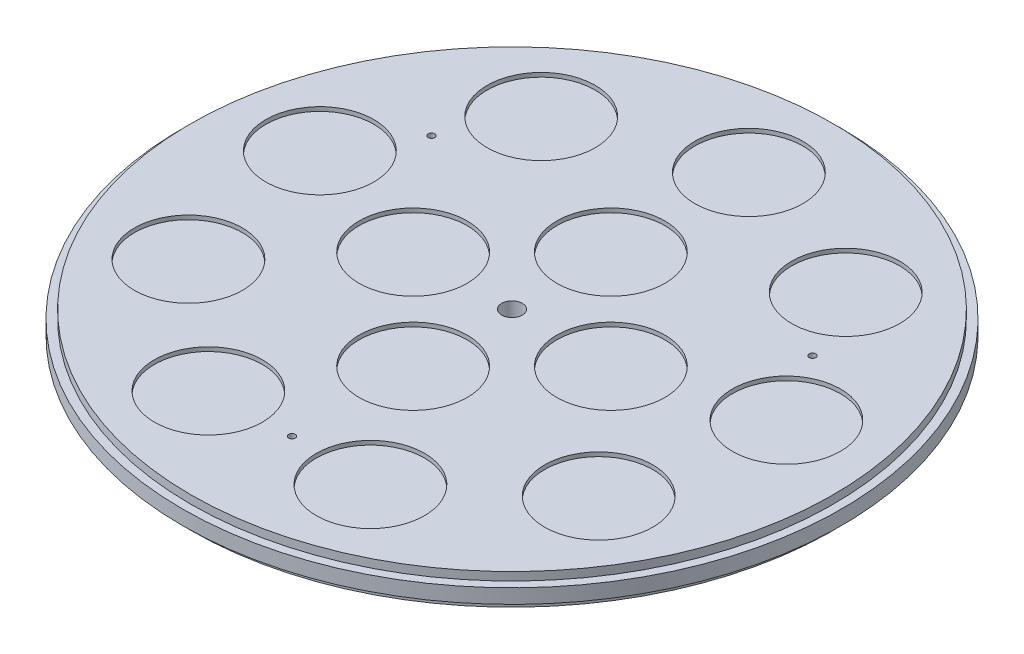
ISO-10303-21;
HEADER;
FILE_DESCRIPTION(('STEP AP214'),'2;1');
FILE_NAME('part.step','',(''),(''),'','','');
FILE_SCHEMA(('AUTOMOTIVE_DESIGN { 1 0 10303 214 1 1 1 1 }'));
ENDSEC;
DATA;
#1=APPLICATION_CONTEXT('core data for automotive mechanical design processes');
#2=APPLICATION_PROTOCOL_DEFINITION('international standard','automotive_design',2000,#1);
#3=PRODUCT_CONTEXT('',#1,'mechanical');
#4=PRODUCT('Part','Part','',(#3));
#5=PRODUCT_RELATED_PRODUCT_CATEGORY('part','',(#4));
#6=PRODUCT_DEFINITION_FORMATION('','',#4);
#7=PRODUCT_DEFINITION_CONTEXT('part definition',#1,'design');
#8=PRODUCT_DEFINITION('design','',#6,#7);
#9=PRODUCT_DEFINITION_SHAPE('','',#8);
#10=(LENGTH_UNIT() NAMED_UNIT(*) SI_UNIT(.MILLI.,.METRE.));
#11=(NAMED_UNIT(*) PLANE_ANGLE_UNIT() SI_UNIT($,.RADIAN.));
#12=(NAMED_UNIT(*) SI_UNIT($,.STERADIAN.) SOLID_ANGLE_UNIT());
#13=UNCERTAINTY_MEASURE_WITH_UNIT(LENGTH_MEASURE(1.E-05),#10,'distance_accuracy_value','');
#14=(GEOMETRIC_REPRESENTATION_CONTEXT(3) GLOBAL_UNCERTAINTY_ASSIGNED_CONTEXT((#13)) GLOBAL_UNIT_ASSIGNED_CONTEXT((#10,
#11,#12)) REPRESENTATION_CONTEXT('',''));
#15=CARTESIAN_POINT('',(0.,0.,0.));
#16=DIRECTION('',(0.,0.,1.));
#17=DIRECTION('',(1.,0.,0.));
#18=AXIS2_PLACEMENT_3D('',#15,#16,#17);
#19=CARTESIAN_POINT('',(0.,7.5,0.));
#20=DIRECTION('',(0.,1.,0.));
#21=DIRECTION('',(0.,0.,1.));
#22=AXIS2_PLACEMENT_3D('',#19,#20,#21);
#23=PLANE('',#22);
#24=CARTESIAN_POINT('',(48.,7.5,-5.0267424559488E-13));
#25=DIRECTION('',(0.,1.,0.));
#26=DIRECTION('',(-1.,0.,0.));
#27=AXIS2_PLACEMENT_3D('',#24,#25,#26);
#28=CIRCLE('',#27,26.25);
#29=CARTESIAN_POINT('',(21.75,7.5,-2.27720090160984E-13));
#30=VERTEX_POINT('',#29);
#31=EDGE_CURVE('E165',#30,#30,#28,.T.);
#32=ORIENTED_EDGE('',*,*,#31,.F.);
#33=EDGE_LOOP('',(#32));
#34=FACE_BOUND('',#33,.T.);
#35=CARTESIAN_POINT('',(0.,7.5,48.));
#36=DIRECTION('',(0.,1.,0.));
#37=DIRECTION('',(0.,0.,-1.));
#38=AXIS2_PLACEMENT_3D('',#35,#36,#37);
#39=CIRCLE('',#38,26.25);
#40=CARTESIAN_POINT('',(0.,7.5,21.75));
#41=VERTEX_POINT('',#40);
#42=EDGE_CURVE('E159',#41,#41,#39,.T.);
#43=ORIENTED_EDGE('',*,*,#42,.F.);
#44=EDGE_LOOP('',(#43));
#45=FACE_BOUND('',#44,.T.);
#46=CARTESIAN_POINT('',(-48.,7.5,1.67492037065939E-13));
#47=DIRECTION('',(0.,1.,0.));
#48=DIRECTION('',(1.,0.,0.));
#49=AXIS2_PLACEMENT_3D('',#46,#47,#48);
#50=CIRCLE('',#49,26.25);
#51=CARTESIAN_POINT('',(-21.75,7.5,0.));
#52=VERTEX_POINT('',#51);
#53=EDGE_CURVE('E153',#52,#52,#50,.T.);
#54=ORIENTED_EDGE('',*,*,#53,.F.);
#55=EDGE_LOOP('',(#54));
#56=FACE_BOUND('',#55,.T.);
#57=CARTESIAN_POINT('',(0.,7.5,-48.));
#58=DIRECTION('',(0.,1.,0.));
#59=DIRECTION('',(0.,0.,1.));
#60=AXIS2_PLACEMENT_3D('',#57,#58,#59);
#61=CIRCLE('',#60,26.25);
#62=CARTESIAN_POINT('',(0.,7.5,-21.75));
#63=VERTEX_POINT('',#62);
#64=EDGE_CURVE('E147',#63,#63,#61,.T.);
#65=ORIENTED_EDGE('',*,*,#64,.F.);
#66=EDGE_LOOP('',(#65));
#67=FACE_BOUND('',#66,.T.);
#68=CARTESIAN_POINT('',(73.920575113951,7.5,-88.0951109586834));
#69=DIRECTION('',(0.,1.,0.));
#70=DIRECTION('',(-0.64278760968653,0.,0.766044443118986));
#71=AXIS2_PLACEMENT_3D('',#68,#69,#70);
#72=CIRCLE('',#71,26.25);
#73=CARTESIAN_POINT('',(57.0474003596795,7.5,-67.98644432681));
#74=VERTEX_POINT('',#73);
#75=EDGE_CURVE('E141',#74,#74,#72,.T.);
#76=ORIENTED_EDGE('',*,*,#75,.F.);
#77=EDGE_LOOP('',(#76));
#78=FACE_BOUND('',#77,.T.);
#79=CARTESIAN_POINT('',(113.252891596404,7.5,-19.9695404316982));
#80=DIRECTION('',(0.,1.,0.));
#81=DIRECTION('',(-0.984807753012206,0.,0.17364817766694));
#82=AXIS2_PLACEMENT_3D('',#79,#80,#81);
#83=CIRCLE('',#82,26.25);
#84=CARTESIAN_POINT('',(87.4016880798333,7.5,-15.411275767941));
#85=VERTEX_POINT('',#84);
#86=EDGE_CURVE('E135',#85,#85,#83,.T.);
#87=ORIENTED_EDGE('',*,*,#86,.F.);
#88=EDGE_LOOP('',(#87));
#89=FACE_BOUND('',#88,.T.);
#90=CARTESIAN_POINT('',(99.592921435211,7.5,57.4999999999991));
#91=DIRECTION('',(0.,1.,0.));
#92=DIRECTION('',(-0.866025403784443,0.,-0.499999999999992));
#93=AXIS2_PLACEMENT_3D('',#90,#91,#92);
#94=CIRCLE('',#93,26.25);
#95=CARTESIAN_POINT('',(76.8597545858693,7.5,44.3749999999993));
#96=VERTEX_POINT('',#95);
#97=EDGE_CURVE('E129',#96,#96,#94,.T.);
#98=ORIENTED_EDGE('',*,*,#97,.F.);
#99=EDGE_LOOP('',(#98));
#100=FACE_BOUND('',#99,.T.);
#101=CARTESIAN_POINT('',(39.3323164824527,7.5,108.064651390379));
#102=DIRECTION('',(0.,1.,0.));
#103=DIRECTION('',(-0.342020143325676,0.,-0.939692620785906));
#104=AXIS2_PLACEMENT_3D('',#101,#102,#103);
#105=CIRCLE('',#104,26.25);
#106=CARTESIAN_POINT('',(30.3542877201537,7.5,83.3977200947491));
#107=VERTEX_POINT('',#106);
#108=EDGE_CURVE('E123',#107,#107,#105,.T.);
#109=ORIENTED_EDGE('',*,*,#108,.F.);
#110=EDGE_LOOP('',(#109));
#111=FACE_BOUND('',#110,.T.);
#112=CARTESIAN_POINT('',(-39.3323164824513,7.5,108.06465139038));
#113=DIRECTION('',(0.,1.,0.));
#114=DIRECTION('',(0.342020143325663,0.,-0.939692620785911));
#115=AXIS2_PLACEMENT_3D('',#112,#113,#114);
#116=CIRCLE('',#115,26.25);
#117=CARTESIAN_POINT('',(-30.3542877201526,7.5,83.3977200947495));
#118=VERTEX_POINT('',#117);
#119=EDGE_CURVE('E117',#118,#118,#116,.T.);
#120=ORIENTED_EDGE('',*,*,#119,.F.);
#121=EDGE_LOOP('',(#120));
#122=FACE_BOUND('',#121,.T.);
#123=CARTESIAN_POINT('',(-99.5929214352102,7.5,57.5000000000005));
#124=DIRECTION('',(0.,1.,0.));
#125=DIRECTION('',(0.866025403784436,0.,-0.500000000000004));
#126=AXIS2_PLACEMENT_3D('',#123,#124,#125);
#127=CIRCLE('',#126,26.25);
#128=CARTESIAN_POINT('',(-76.8597545858687,7.5,44.3750000000004));
#129=VERTEX_POINT('',#128);
#130=EDGE_CURVE('E111',#129,#129,#127,.T.);
#131=ORIENTED_EDGE('',*,*,#130,.F.);
#132=EDGE_LOOP('',(#131));
#133=FACE_BOUND('',#132,.T.);
#134=CARTESIAN_POINT('',(-113.252891596404,7.5,-19.9695404316966));
#135=DIRECTION('',(0.,1.,0.));
#136=DIRECTION('',(0.984807753012209,0.,0.173648177666927));
#137=AXIS2_PLACEMENT_3D('',#134,#135,#136);
#138=CIRCLE('',#137,26.25);
#139=CARTESIAN_POINT('',(-87.4016880798335,7.5,-15.4112757679398));
#140=VERTEX_POINT('',#139);
#141=EDGE_CURVE('E105',#140,#140,#138,.T.);
#142=ORIENTED_EDGE('',*,*,#141,.F.);
#143=EDGE_LOOP('',(#142));
#144=FACE_BOUND('',#143,.T.);
#145=CARTESIAN_POINT('',(-73.9205751139522,7.5,-88.0951109586824));
#146=DIRECTION('',(0.,1.,0.));
#147=DIRECTION('',(0.642787609686541,0.,0.766044443118977));
#148=AXIS2_PLACEMENT_3D('',#145,#146,#147);
#149=CIRCLE('',#148,26.25);
#150=CARTESIAN_POINT('',(-57.0474003596805,7.5,-67.9864443268092));
#151=VERTEX_POINT('',#150);
#152=EDGE_CURVE('E99',#151,#151,#149,.T.);
#153=ORIENTED_EDGE('',*,*,#152,.F.);
#154=EDGE_LOOP('',(#153));
#155=FACE_BOUND('',#154,.T.);
#156=CARTESIAN_POINT('',(0.,7.5,-115.));
#157=DIRECTION('',(0.,1.,0.));
#158=DIRECTION('',(0.,0.,1.));
#159=AXIS2_PLACEMENT_3D('',#156,#157,#158);
#160=CIRCLE('',#159,26.25);
#161=CARTESIAN_POINT('',(0.,7.5,-88.75));
#162=VERTEX_POINT('',#161);
#163=EDGE_CURVE('E93',#162,#162,#160,.T.);
#164=ORIENTED_EDGE('',*,*,#163,.F.);
#165=EDGE_LOOP('',(#164));
#166=FACE_BOUND('',#165,.T.);
#167=CARTESIAN_POINT('',(0.,7.5,106.8));
#168=DIRECTION('',(0.,-1.,0.));
#169=DIRECTION('',(0.,0.,-1.));
#170=AXIS2_PLACEMENT_3D('',#167,#168,#169);
#171=CIRCLE('',#170,1.6);
#172=CARTESIAN_POINT('',(0.,7.5,105.2));
#173=VERTEX_POINT('',#172);
#174=EDGE_CURVE('E46',#173,#173,#171,.T.);
#175=ORIENTED_EDGE('',*,*,#174,.T.);
#176=EDGE_LOOP('',(#175));
#177=FACE_BOUND('',#176,.T.);
#178=CARTESIAN_POINT('',(-92.4915131241778,7.5,-53.4000000000004));
#179=DIRECTION('',(0.,-1.,0.));
#180=DIRECTION('',(0.866025403784436,0.,0.500000000000004));
#181=AXIS2_PLACEMENT_3D('',#178,#179,#180);
#182=CIRCLE('',#181,1.6);
#183=CARTESIAN_POINT('',(-91.1058724781227,7.5,-52.6000000000004));
#184=VERTEX_POINT('',#183);
#185=EDGE_CURVE('E51',#184,#184,#182,.T.);
#186=ORIENTED_EDGE('',*,*,#185,.T.);
#187=EDGE_LOOP('',(#186));
#188=FACE_BOUND('',#187,.T.);
#189=CARTESIAN_POINT('',(92.4915131241785,7.5,-53.3999999999991));
#190=DIRECTION('',(0.,-1.,0.));
#191=DIRECTION('',(-0.866025403784443,0.,0.499999999999992));
#192=AXIS2_PLACEMENT_3D('',#189,#190,#191);
#193=CIRCLE('',#192,1.6);
#194=CARTESIAN_POINT('',(91.1058724781234,7.5,-52.5999999999991));
#195=VERTEX_POINT('',#194);
#196=EDGE_CURVE('E57',#195,#195,#193,.T.);
#197=ORIENTED_EDGE('',*,*,#196,.T.);
#198=EDGE_LOOP('',(#197));
#199=FACE_BOUND('',#198,.T.);
#200=CARTESIAN_POINT('',(0.,7.5,0.));
#201=DIRECTION('',(0.,1.,0.));
#202=DIRECTION('',(0.,0.,1.));
#203=AXIS2_PLACEMENT_3D('',#200,#201,#202);
#204=CIRCLE('',#203,5.);
#205=CARTESIAN_POINT('',(0.,7.5,5.));
#206=VERTEX_POINT('',#205);
#207=EDGE_CURVE('E71',#206,#206,#204,.T.);
#208=ORIENTED_EDGE('',*,*,#207,.F.);
#209=EDGE_LOOP('',(#208));
#210=FACE_BOUND('',#209,.T.);
#211=CARTESIAN_POINT('',(0.,7.5,0.));
#212=DIRECTION('',(0.,1.,0.));
#213=DIRECTION('',(0.,0.,1.));
#214=AXIS2_PLACEMENT_3D('',#211,#212,#213);
#215=CIRCLE('',#214,156.);
#216=CARTESIAN_POINT('',(0.,7.5,156.));
#217=VERTEX_POINT('',#216);
#218=EDGE_CURVE('E87',#217,#217,#215,.T.);
#219=ORIENTED_EDGE('',*,*,#218,.T.);
#220=EDGE_LOOP('',(#219));
#221=FACE_BOUND('',#220,.T.);
#222=ADVANCED_FACE('F33',(#34,#45,#56,#67,#78,#89,#100,#111,#122,#133,#144,#155,#166,#177,#188,
#199,#210,#221),#23,.T.);
#223=CARTESIAN_POINT('',(0.,-7.5,0.));
#224=DIRECTION('',(0.,1.,0.));
#225=DIRECTION('',(0.,0.,1.));
#226=AXIS2_PLACEMENT_3D('',#223,#224,#225);
#227=PLANE('',#226);
#228=CARTESIAN_POINT('',(0.,-7.5,0.));
#229=DIRECTION('',(0.,-1.,0.));
#230=DIRECTION('',(0.,0.,-1.));
#231=AXIS2_PLACEMENT_3D('',#228,#229,#230);
#232=CIRCLE('',#231,110.25);
#233=CARTESIAN_POINT('',(0.,-7.5,-110.25));
#234=VERTEX_POINT('',#233);
#235=EDGE_CURVE('E41',#234,#234,#232,.T.);
#236=ORIENTED_EDGE('',*,*,#235,.F.);
#237=EDGE_LOOP('',(#236));
#238=FACE_BOUND('',#237,.T.);
#239=CARTESIAN_POINT('',(0.,-7.5,0.));
#240=DIRECTION('',(0.,1.,0.));
#241=DIRECTION('',(0.,0.,1.));
#242=AXIS2_PLACEMENT_3D('',#239,#240,#241);
#243=CIRCLE('',#242,156.);
#244=CARTESIAN_POINT('',(0.,-7.5,156.));
#245=VERTEX_POINT('',#244);
#246=EDGE_CURVE('E78',#245,#245,#243,.T.);
#247=ORIENTED_EDGE('',*,*,#246,.F.);
#248=EDGE_LOOP('',(#247));
#249=FACE_BOUND('',#248,.T.);
#250=ADVANCED_FACE('F182',(#238,#249),#227,.F.);
#251=CARTESIAN_POINT('',(0.,7.5,0.));
#252=DIRECTION('',(0.,-1.,0.));
#253=DIRECTION('',(0.,0.,-1.));
#254=AXIS2_PLACEMENT_3D('',#251,#252,#253);
#255=CYLINDRICAL_SURFACE('',#254,160.);
#256=CARTESIAN_POINT('',(0.,3.5,0.));
#257=DIRECTION('',(0.,1.,0.));
#258=DIRECTION('',(0.,0.,1.));
#259=AXIS2_PLACEMENT_3D('',#256,#257,#258);
#260=CIRCLE('',#259,160.);
#261=CARTESIAN_POINT('',(0.,3.5,160.));
#262=VERTEX_POINT('',#261);
#263=EDGE_CURVE('E81',#262,#262,#260,.T.);
#264=ORIENTED_EDGE('',*,*,#263,.F.);
#265=EDGE_LOOP('',(#264));
#266=FACE_BOUND('',#265,.T.);
#267=CARTESIAN_POINT('',(0.,-3.5,0.));
#268=DIRECTION('',(0.,1.,0.));
#269=DIRECTION('',(0.,0.,1.));
#270=AXIS2_PLACEMENT_3D('',#267,#268,#269);
#271=CIRCLE('',#270,160.);
#272=CARTESIAN_POINT('',(0.,-3.5,160.));
#273=VERTEX_POINT('',#272);
#274=EDGE_CURVE('E74',#273,#273,#271,.T.);
#275=ORIENTED_EDGE('',*,*,#274,.T.);
#276=EDGE_LOOP('',(#275));
#277=FACE_BOUND('',#276,.T.);
#278=ADVANCED_FACE('F35',(#266,#277),#255,.T.);
#279=CARTESIAN_POINT('',(0.,-5.5,0.));
#280=DIRECTION('',(0.,-1.,0.));
#281=DIRECTION('',(0.,0.,-1.));
#282=AXIS2_PLACEMENT_3D('',#279,#280,#281);
#283=CYLINDRICAL_SURFACE('',#282,110.25);
#284=CARTESIAN_POINT('',(0.,-5.5,0.));
#285=DIRECTION('',(0.,-1.,0.));
#286=DIRECTION('',(0.,0.,-1.));
#287=AXIS2_PLACEMENT_3D('',#284,#285,#286);
#288=CIRCLE('',#287,110.25);
#289=CARTESIAN_POINT('',(0.,-5.5,-110.25));
#290=VERTEX_POINT('',#289);
#291=EDGE_CURVE('E11',#290,#290,#288,.T.);
#292=ORIENTED_EDGE('',*,*,#291,.F.);
#293=EDGE_LOOP('',(#292));
#294=FACE_BOUND('',#293,.T.);
#295=ORIENTED_EDGE('',*,*,#235,.T.);
#296=EDGE_LOOP('',(#295));
#297=FACE_BOUND('',#296,.T.);
#298=ADVANCED_FACE('F270',(#294,#297),#283,.F.);
#299=CARTESIAN_POINT('',(0.,-5.5,0.));
#300=DIRECTION('',(0.,-1.,0.));
#301=DIRECTION('',(0.,0.,-1.));
#302=AXIS2_PLACEMENT_3D('',#299,#300,#301);
#303=PLANE('',#302);
#304=CARTESIAN_POINT('',(0.,-5.5,0.));
#305=DIRECTION('',(0.,-1.,0.));
#306=DIRECTION('',(0.,0.,-1.));
#307=AXIS2_PLACEMENT_3D('',#304,#305,#306);
#308=CIRCLE('',#307,1.);
#309=CARTESIAN_POINT('',(0.,-5.5,-1.));
#310=VERTEX_POINT('',#309);
#311=EDGE_CURVE('E63',#310,#310,#308,.T.);
#312=ORIENTED_EDGE('',*,*,#311,.F.);
#313=EDGE_LOOP('',(#312));
#314=FACE_BOUND('',#313,.T.);
#315=CARTESIAN_POINT('',(92.4915131241785,-5.5,-53.3999999999991));
#316=DIRECTION('',(0.,-1.,0.));
#317=DIRECTION('',(-0.866025403784443,0.,0.499999999999992));
#318=AXIS2_PLACEMENT_3D('',#315,#316,#317);
#319=CIRCLE('',#318,1.6);
#320=CARTESIAN_POINT('',(91.1058724781234,-5.5,-52.5999999999991));
#321=VERTEX_POINT('',#320);
#322=EDGE_CURVE('E60',#321,#321,#319,.T.);
#323=ORIENTED_EDGE('',*,*,#322,.F.);
#324=EDGE_LOOP('',(#323));
#325=FACE_BOUND('',#324,.T.);
#326=CARTESIAN_POINT('',(-92.4915131241778,-5.5,-53.4000000000004));
#327=DIRECTION('',(0.,-1.,0.));
#328=DIRECTION('',(0.866025403784436,0.,0.500000000000004));
#329=AXIS2_PLACEMENT_3D('',#326,#327,#328);
#330=CIRCLE('',#329,1.6);
#331=CARTESIAN_POINT('',(-91.1058724781227,-5.5,-52.6000000000004));
#332=VERTEX_POINT('',#331);
#333=EDGE_CURVE('E54',#332,#332,#330,.T.);
#334=ORIENTED_EDGE('',*,*,#333,.F.);
#335=EDGE_LOOP('',(#334));
#336=FACE_BOUND('',#335,.T.);
#337=CARTESIAN_POINT('',(0.,-5.5,106.8));
#338=DIRECTION('',(0.,-1.,0.));
#339=DIRECTION('',(0.,0.,-1.));
#340=AXIS2_PLACEMENT_3D('',#337,#338,#339);
#341=CIRCLE('',#340,1.6);
#342=CARTESIAN_POINT('',(0.,-5.5,105.2));
#343=VERTEX_POINT('',#342);
#344=EDGE_CURVE('E48',#343,#343,#341,.T.);
#345=ORIENTED_EDGE('',*,*,#344,.F.);
#346=EDGE_LOOP('',(#345));
#347=FACE_BOUND('',#346,.T.);
#348=ORIENTED_EDGE('',*,*,#291,.T.);
#349=EDGE_LOOP('',(#348));
#350=FACE_BOUND('',#349,.T.);
#351=ADVANCED_FACE('F266',(#314,#325,#336,#347,#350),#303,.T.);
#352=CARTESIAN_POINT('',(0.,7.5,106.8));
#353=DIRECTION('',(0.,-1.,0.));
#354=DIRECTION('',(0.,0.,-1.));
#355=AXIS2_PLACEMENT_3D('',#352,#353,#354);
#356=CYLINDRICAL_SURFACE('',#355,1.6);
#357=ORIENTED_EDGE('',*,*,#174,.F.);
#358=EDGE_LOOP('',(#357));
#359=FACE_BOUND('',#358,.T.);
#360=ORIENTED_EDGE('',*,*,#344,.T.);
#361=EDGE_LOOP('',(#360));
#362=FACE_BOUND('',#361,.T.);
#363=ADVANCED_FACE('F262',(#359,#362),#356,.F.);
#364=CARTESIAN_POINT('',(-92.4915131241778,7.5,-53.4000000000004));
#365=DIRECTION('',(0.,-1.,0.));
#366=DIRECTION('',(0.,0.,-1.));
#367=AXIS2_PLACEMENT_3D('',#364,#365,#366);
#368=CYLINDRICAL_SURFACE('',#367,1.6);
#369=ORIENTED_EDGE('',*,*,#185,.F.);
#370=EDGE_LOOP('',(#369));
#371=FACE_BOUND('',#370,.T.);
#372=ORIENTED_EDGE('',*,*,#333,.T.);
#373=EDGE_LOOP('',(#372));
#374=FACE_BOUND('',#373,.T.);
#375=ADVANCED_FACE('F258',(#371,#374),#368,.F.);
#376=CARTESIAN_POINT('',(92.4915131241785,7.5,-53.3999999999991));
#377=DIRECTION('',(0.,-1.,0.));
#378=DIRECTION('',(0.,0.,-1.));
#379=AXIS2_PLACEMENT_3D('',#376,#377,#378);
#380=CYLINDRICAL_SURFACE('',#379,1.6);
#381=ORIENTED_EDGE('',*,*,#196,.F.);
#382=EDGE_LOOP('',(#381));
#383=FACE_BOUND('',#382,.T.);
#384=ORIENTED_EDGE('',*,*,#322,.T.);
#385=EDGE_LOOP('',(#384));
#386=FACE_BOUND('',#385,.T.);
#387=ADVANCED_FACE('F254',(#383,#386),#380,.F.);
#388=CARTESIAN_POINT('',(0.,7.5,0.));
#389=DIRECTION('',(0.,-1.,0.));
#390=DIRECTION('',(0.,0.,-1.));
#391=AXIS2_PLACEMENT_3D('',#388,#389,#390);
#392=CYLINDRICAL_SURFACE('',#391,1.);
#393=CARTESIAN_POINT('',(0.,-3.5,0.));
#394=DIRECTION('',(0.,-1.,0.));
#395=DIRECTION('',(0.,0.,-1.));
#396=AXIS2_PLACEMENT_3D('',#393,#394,#395);
#397=CIRCLE('',#396,1.);
#398=CARTESIAN_POINT('',(0.,-3.5,-1.));
#399=VERTEX_POINT('',#398);
#400=EDGE_CURVE('E37',#399,#399,#397,.F.);
#401=ORIENTED_EDGE('',*,*,#400,.T.);
#402=EDGE_LOOP('',(#401));
#403=FACE_BOUND('',#402,.T.);
#404=ORIENTED_EDGE('',*,*,#311,.T.);
#405=EDGE_LOOP('',(#404));
#406=FACE_BOUND('',#405,.T.);
#407=ADVANCED_FACE('F250',(#403,#406),#392,.F.);
#408=CARTESIAN_POINT('',(0.,-3.5,0.));
#409=DIRECTION('',(0.,-1.,0.));
#410=DIRECTION('',(0.,0.,-1.));
#411=AXIS2_PLACEMENT_3D('',#408,#409,#410);
#412=PLANE('',#411);
#413=CARTESIAN_POINT('',(0.,-3.5,0.));
#414=DIRECTION('',(0.,-1.,0.));
#415=DIRECTION('',(0.,0.,-1.));
#416=AXIS2_PLACEMENT_3D('',#413,#414,#415);
#417=CIRCLE('',#416,5.);
#418=CARTESIAN_POINT('',(0.,-3.5,-5.));
#419=VERTEX_POINT('',#418);
#420=EDGE_CURVE('E68',#419,#419,#417,.F.);
#421=ORIENTED_EDGE('',*,*,#420,.T.);
#422=EDGE_LOOP('',(#421));
#423=FACE_BOUND('',#422,.T.);
#424=ORIENTED_EDGE('',*,*,#400,.F.);
#425=EDGE_LOOP('',(#424));
#426=FACE_BOUND('',#425,.T.);
#427=ADVANCED_FACE('F246',(#423,#426),#412,.F.);
#428=CARTESIAN_POINT('',(0.,-19.6421356237309,0.));
#429=DIRECTION('',(0.,1.,0.));
#430=DIRECTION('',(0.,0.,1.));
#431=AXIS2_PLACEMENT_3D('',#428,#429,#430);
#432=CYLINDRICAL_SURFACE('',#431,5.);
#433=ORIENTED_EDGE('',*,*,#207,.T.);
#434=EDGE_LOOP('',(#433));
#435=FACE_BOUND('',#434,.T.);
#436=ORIENTED_EDGE('',*,*,#420,.F.);
#437=EDGE_LOOP('',(#436));
#438=FACE_BOUND('',#437,.T.);
#439=ADVANCED_FACE('F242',(#435,#438),#432,.F.);
#440=CARTESIAN_POINT('',(0.,-3.5,0.));
#441=DIRECTION('',(0.,1.,0.));
#442=DIRECTION('',(0.,0.,1.));
#443=AXIS2_PLACEMENT_3D('',#440,#441,#442);
#444=PLANE('',#443);
#445=ORIENTED_EDGE('',*,*,#274,.F.);
#446=EDGE_LOOP('',(#445));
#447=FACE_BOUND('',#446,.T.);
#448=CARTESIAN_POINT('',(0.,-3.5,0.));
#449=DIRECTION('',(0.,1.,0.));
#450=DIRECTION('',(0.,0.,1.));
#451=AXIS2_PLACEMENT_3D('',#448,#449,#450);
#452=CIRCLE('',#451,156.);
#453=CARTESIAN_POINT('',(0.,-3.5,156.));
#454=VERTEX_POINT('',#453);
#455=EDGE_CURVE('E77',#454,#454,#452,.T.);
#456=ORIENTED_EDGE('',*,*,#455,.T.);
#457=EDGE_LOOP('',(#456));
#458=FACE_BOUND('',#457,.T.);
#459=ADVANCED_FACE('F238',(#447,#458),#444,.F.);
#460=CARTESIAN_POINT('',(0.,-3.5,0.));
#461=DIRECTION('',(0.,-1.,0.));
#462=DIRECTION('',(0.,0.,-1.));
#463=AXIS2_PLACEMENT_3D('',#460,#461,#462);
#464=CYLINDRICAL_SURFACE('',#463,156.);
#465=ORIENTED_EDGE('',*,*,#455,.F.);
#466=EDGE_LOOP('',(#465));
#467=FACE_BOUND('',#466,.T.);
#468=ORIENTED_EDGE('',*,*,#246,.T.);
#469=EDGE_LOOP('',(#468));
#470=FACE_BOUND('',#469,.T.);
#471=ADVANCED_FACE('F231',(#467,#470),#464,.T.);
#472=CARTESIAN_POINT('',(0.,3.5,0.));
#473=DIRECTION('',(0.,-1.,0.));
#474=DIRECTION('',(0.,0.,1.));
#475=AXIS2_PLACEMENT_3D('',#472,#473,#474);
#476=PLANE('',#475);
#477=CARTESIAN_POINT('',(0.,3.5,0.));
#478=DIRECTION('',(0.,1.,0.));
#479=DIRECTION('',(0.,0.,1.));
#480=AXIS2_PLACEMENT_3D('',#477,#478,#479);
#481=CIRCLE('',#480,156.);
#482=CARTESIAN_POINT('',(0.,3.5,156.));
#483=VERTEX_POINT('',#482);
#484=EDGE_CURVE('E86',#483,#483,#481,.T.);
#485=ORIENTED_EDGE('',*,*,#484,.F.);
#486=EDGE_LOOP('',(#485));
#487=FACE_BOUND('',#486,.T.);
#488=ORIENTED_EDGE('',*,*,#263,.T.);
#489=EDGE_LOOP('',(#488));
#490=FACE_BOUND('',#489,.T.);
#491=ADVANCED_FACE('F221',(#487,#490),#476,.F.);
#492=CARTESIAN_POINT('',(0.,3.5,0.));
#493=DIRECTION('',(0.,1.,0.));
#494=DIRECTION('',(0.,0.,1.));
#495=AXIS2_PLACEMENT_3D('',#492,#493,#494);
#496=CYLINDRICAL_SURFACE('',#495,156.);
#497=ORIENTED_EDGE('',*,*,#484,.T.);
#498=EDGE_LOOP('',(#497));
#499=FACE_BOUND('',#498,.T.);
#500=ORIENTED_EDGE('',*,*,#218,.F.);
#501=EDGE_LOOP('',(#500));
#502=FACE_BOUND('',#501,.T.);
#503=ADVANCED_FACE('F218',(#499,#502),#496,.T.);
#504=CARTESIAN_POINT('',(0.,5.5,-115.));
#505=DIRECTION('',(0.,1.,0.));
#506=DIRECTION('',(0.,0.,1.));
#507=AXIS2_PLACEMENT_3D('',#504,#505,#506);
#508=CYLINDRICAL_SURFACE('',#507,26.25);
#509=CARTESIAN_POINT('',(0.,5.5,-115.));
#510=DIRECTION('',(0.,1.,0.));
#511=DIRECTION('',(0.,0.,1.));
#512=AXIS2_PLACEMENT_3D('',#509,#510,#511);
#513=CIRCLE('',#512,26.25);
#514=CARTESIAN_POINT('',(0.,5.5,-88.75));
#515=VERTEX_POINT('',#514);
#516=EDGE_CURVE('E90',#515,#515,#513,.T.);
#517=ORIENTED_EDGE('',*,*,#516,.F.);
#518=EDGE_LOOP('',(#517));
#519=FACE_BOUND('',#518,.T.);
#520=ORIENTED_EDGE('',*,*,#163,.T.);
#521=EDGE_LOOP('',(#520));
#522=FACE_BOUND('',#521,.T.);
#523=ADVANCED_FACE('F220',(#519,#522),#508,.F.);
#524=CARTESIAN_POINT('',(0.,5.5,-115.));
#525=DIRECTION('',(0.,1.,0.));
#526=DIRECTION('',(0.,0.,1.));
#527=AXIS2_PLACEMENT_3D('',#524,#525,#526);
#528=PLANE('',#527);
#529=ORIENTED_EDGE('',*,*,#516,.T.);
#530=EDGE_LOOP('',(#529));
#531=FACE_BOUND('',#530,.T.);
#532=ADVANCED_FACE('F228',(#531),#528,.T.);
#533=CARTESIAN_POINT('',(-73.9205751139522,5.5,-88.0951109586824));
#534=DIRECTION('',(0.,1.,0.));
#535=DIRECTION('',(0.,0.,1.));
#536=AXIS2_PLACEMENT_3D('',#533,#534,#535);
#537=CYLINDRICAL_SURFACE('',#536,26.25);
#538=CARTESIAN_POINT('',(-73.9205751139522,5.5,-88.0951109586824));
#539=DIRECTION('',(0.,1.,0.));
#540=DIRECTION('',(0.642787609686541,0.,0.766044443118977));
#541=AXIS2_PLACEMENT_3D('',#538,#539,#540);
#542=CIRCLE('',#541,26.25);
#543=CARTESIAN_POINT('',(-57.0474003596805,5.5,-67.9864443268092));
#544=VERTEX_POINT('',#543);
#545=EDGE_CURVE('E96',#544,#544,#542,.T.);
#546=ORIENTED_EDGE('',*,*,#545,.F.);
#547=EDGE_LOOP('',(#546));
#548=FACE_BOUND('',#547,.T.);
#549=ORIENTED_EDGE('',*,*,#152,.T.);
#550=EDGE_LOOP('',(#549));
#551=FACE_BOUND('',#550,.T.);
#552=ADVANCED_FACE('F357',(#548,#551),#537,.F.);
#553=CARTESIAN_POINT('',(-73.9205751139522,5.5,-88.0951109586824));
#554=DIRECTION('',(0.,1.,0.));
#555=DIRECTION('',(0.642787609686541,0.,0.766044443118977));
#556=AXIS2_PLACEMENT_3D('',#553,#554,#555);
#557=PLANE('',#556);
#558=ORIENTED_EDGE('',*,*,#545,.T.);
#559=EDGE_LOOP('',(#558));
#560=FACE_BOUND('',#559,.T.);
#561=ADVANCED_FACE('F366',(#560),#557,.T.);
#562=CARTESIAN_POINT('',(-113.252891596404,5.5,-19.9695404316966));
#563=DIRECTION('',(0.,1.,0.));
#564=DIRECTION('',(0.,0.,1.));
#565=AXIS2_PLACEMENT_3D('',#562,#563,#564);
#566=CYLINDRICAL_SURFACE('',#565,26.25);
#567=CARTESIAN_POINT('',(-113.252891596404,5.5,-19.9695404316966));
#568=DIRECTION('',(0.,1.,0.));
#569=DIRECTION('',(0.984807753012209,0.,0.173648177666927));
#570=AXIS2_PLACEMENT_3D('',#567,#568,#569);
#571=CIRCLE('',#570,26.25);
#572=CARTESIAN_POINT('',(-87.4016880798335,5.5,-15.4112757679398));
#573=VERTEX_POINT('',#572);
#574=EDGE_CURVE('E102',#573,#573,#571,.T.);
#575=ORIENTED_EDGE('',*,*,#574,.F.);
#576=EDGE_LOOP('',(#575));
#577=FACE_BOUND('',#576,.T.);
#578=ORIENTED_EDGE('',*,*,#141,.T.);
#579=EDGE_LOOP('',(#578));
#580=FACE_BOUND('',#579,.T.);
#581=ADVANCED_FACE('F376',(#577,#580),#566,.F.);
#582=CARTESIAN_POINT('',(-113.252891596404,5.5,-19.9695404316966));
#583=DIRECTION('',(0.,1.,0.));
#584=DIRECTION('',(0.984807753012209,0.,0.173648177666927));
#585=AXIS2_PLACEMENT_3D('',#582,#583,#584);
#586=PLANE('',#585);
#587=ORIENTED_EDGE('',*,*,#574,.T.);
#588=EDGE_LOOP('',(#587));
#589=FACE_BOUND('',#588,.T.);
#590=ADVANCED_FACE('F386',(#589),#586,.T.);
#591=CARTESIAN_POINT('',(-99.5929214352102,5.5,57.5000000000005));
#592=DIRECTION('',(0.,1.,0.));
#593=DIRECTION('',(0.,0.,1.));
#594=AXIS2_PLACEMENT_3D('',#591,#592,#593);
#595=CYLINDRICAL_SURFACE('',#594,26.25);
#596=CARTESIAN_POINT('',(-99.5929214352102,5.5,57.5000000000005));
#597=DIRECTION('',(0.,1.,0.));
#598=DIRECTION('',(0.866025403784436,0.,-0.500000000000004));
#599=AXIS2_PLACEMENT_3D('',#596,#597,#598);
#600=CIRCLE('',#599,26.25);
#601=CARTESIAN_POINT('',(-76.8597545858687,5.5,44.3750000000004));
#602=VERTEX_POINT('',#601);
#603=EDGE_CURVE('E108',#602,#602,#600,.T.);
#604=ORIENTED_EDGE('',*,*,#603,.F.);
#605=EDGE_LOOP('',(#604));
#606=FACE_BOUND('',#605,.T.);
#607=ORIENTED_EDGE('',*,*,#130,.T.);
#608=EDGE_LOOP('',(#607));
#609=FACE_BOUND('',#608,.T.);
#610=ADVANCED_FACE('F396',(#606,#609),#595,.F.);
#611=CARTESIAN_POINT('',(-99.5929214352102,5.5,57.5000000000005));
#612=DIRECTION('',(0.,1.,0.));
#613=DIRECTION('',(0.866025403784436,0.,-0.500000000000004));
#614=AXIS2_PLACEMENT_3D('',#611,#612,#613);
#615=PLANE('',#614);
#616=ORIENTED_EDGE('',*,*,#603,.T.);
#617=EDGE_LOOP('',(#616));
#618=FACE_BOUND('',#617,.T.);
#619=ADVANCED_FACE('F406',(#618),#615,.T.);
#620=CARTESIAN_POINT('',(-39.3323164824513,5.5,108.06465139038));
#621=DIRECTION('',(0.,1.,0.));
#622=DIRECTION('',(0.,0.,1.));
#623=AXIS2_PLACEMENT_3D('',#620,#621,#622);
#624=CYLINDRICAL_SURFACE('',#623,26.25);
#625=CARTESIAN_POINT('',(-39.3323164824513,5.5,108.06465139038));
#626=DIRECTION('',(0.,1.,0.));
#627=DIRECTION('',(0.342020143325663,0.,-0.939692620785911));
#628=AXIS2_PLACEMENT_3D('',#625,#626,#627);
#629=CIRCLE('',#628,26.25);
#630=CARTESIAN_POINT('',(-30.3542877201526,5.5,83.3977200947495));
#631=VERTEX_POINT('',#630);
#632=EDGE_CURVE('E114',#631,#631,#629,.T.);
#633=ORIENTED_EDGE('',*,*,#632,.F.);
#634=EDGE_LOOP('',(#633));
#635=FACE_BOUND('',#634,.T.);
#636=ORIENTED_EDGE('',*,*,#119,.T.);
#637=EDGE_LOOP('',(#636));
#638=FACE_BOUND('',#637,.T.);
#639=ADVANCED_FACE('F416',(#635,#638),#624,.F.);
#640=CARTESIAN_POINT('',(-39.3323164824513,5.5,108.06465139038));
#641=DIRECTION('',(0.,1.,0.));
#642=DIRECTION('',(0.342020143325663,0.,-0.939692620785911));
#643=AXIS2_PLACEMENT_3D('',#640,#641,#642);
#644=PLANE('',#643);
#645=ORIENTED_EDGE('',*,*,#632,.T.);
#646=EDGE_LOOP('',(#645));
#647=FACE_BOUND('',#646,.T.);
#648=ADVANCED_FACE('F426',(#647),#644,.T.);
#649=CARTESIAN_POINT('',(39.3323164824527,5.5,108.064651390379));
#650=DIRECTION('',(0.,1.,0.));
#651=DIRECTION('',(0.,0.,1.));
#652=AXIS2_PLACEMENT_3D('',#649,#650,#651);
#653=CYLINDRICAL_SURFACE('',#652,26.25);
#654=CARTESIAN_POINT('',(39.3323164824527,5.5,108.064651390379));
#655=DIRECTION('',(0.,1.,0.));
#656=DIRECTION('',(-0.342020143325676,0.,-0.939692620785906));
#657=AXIS2_PLACEMENT_3D('',#654,#655,#656);
#658=CIRCLE('',#657,26.25);
#659=CARTESIAN_POINT('',(30.3542877201537,5.5,83.3977200947491));
#660=VERTEX_POINT('',#659);
#661=EDGE_CURVE('E120',#660,#660,#658,.T.);
#662=ORIENTED_EDGE('',*,*,#661,.F.);
#663=EDGE_LOOP('',(#662));
#664=FACE_BOUND('',#663,.T.);
#665=ORIENTED_EDGE('',*,*,#108,.T.);
#666=EDGE_LOOP('',(#665));
#667=FACE_BOUND('',#666,.T.);
#668=ADVANCED_FACE('F436',(#664,#667),#653,.F.);
#669=CARTESIAN_POINT('',(39.3323164824527,5.5,108.064651390379));
#670=DIRECTION('',(0.,1.,0.));
#671=DIRECTION('',(-0.342020143325676,0.,-0.939692620785906));
#672=AXIS2_PLACEMENT_3D('',#669,#670,#671);
#673=PLANE('',#672);
#674=ORIENTED_EDGE('',*,*,#661,.T.);
#675=EDGE_LOOP('',(#674));
#676=FACE_BOUND('',#675,.T.);
#677=ADVANCED_FACE('F446',(#676),#673,.T.);
#678=CARTESIAN_POINT('',(99.592921435211,5.5,57.4999999999991));
#679=DIRECTION('',(0.,1.,0.));
#680=DIRECTION('',(0.,0.,1.));
#681=AXIS2_PLACEMENT_3D('',#678,#679,#680);
#682=CYLINDRICAL_SURFACE('',#681,26.25);
#683=CARTESIAN_POINT('',(99.592921435211,5.5,57.4999999999991));
#684=DIRECTION('',(0.,1.,0.));
#685=DIRECTION('',(-0.866025403784443,0.,-0.499999999999992));
#686=AXIS2_PLACEMENT_3D('',#683,#684,#685);
#687=CIRCLE('',#686,26.25);
#688=CARTESIAN_POINT('',(76.8597545858693,5.5,44.3749999999993));
#689=VERTEX_POINT('',#688);
#690=EDGE_CURVE('E126',#689,#689,#687,.T.);
#691=ORIENTED_EDGE('',*,*,#690,.F.);
#692=EDGE_LOOP('',(#691));
#693=FACE_BOUND('',#692,.T.);
#694=ORIENTED_EDGE('',*,*,#97,.T.);
#695=EDGE_LOOP('',(#694));
#696=FACE_BOUND('',#695,.T.);
#697=ADVANCED_FACE('F456',(#693,#696),#682,.F.);
#698=CARTESIAN_POINT('',(99.592921435211,5.5,57.4999999999991));
#699=DIRECTION('',(0.,1.,0.));
#700=DIRECTION('',(-0.866025403784443,0.,-0.499999999999992));
#701=AXIS2_PLACEMENT_3D('',#698,#699,#700);
#702=PLANE('',#701);
#703=ORIENTED_EDGE('',*,*,#690,.T.);
#704=EDGE_LOOP('',(#703));
#705=FACE_BOUND('',#704,.T.);
#706=ADVANCED_FACE('F466',(#705),#702,.T.);
#707=CARTESIAN_POINT('',(113.252891596404,5.5,-19.9695404316982));
#708=DIRECTION('',(0.,1.,0.));
#709=DIRECTION('',(0.,0.,1.));
#710=AXIS2_PLACEMENT_3D('',#707,#708,#709);
#711=CYLINDRICAL_SURFACE('',#710,26.25);
#712=CARTESIAN_POINT('',(113.252891596404,5.5,-19.9695404316982));
#713=DIRECTION('',(0.,1.,0.));
#714=DIRECTION('',(-0.984807753012206,0.,0.17364817766694));
#715=AXIS2_PLACEMENT_3D('',#712,#713,#714);
#716=CIRCLE('',#715,26.25);
#717=CARTESIAN_POINT('',(87.4016880798333,5.5,-15.411275767941));
#718=VERTEX_POINT('',#717);
#719=EDGE_CURVE('E132',#718,#718,#716,.T.);
#720=ORIENTED_EDGE('',*,*,#719,.F.);
#721=EDGE_LOOP('',(#720));
#722=FACE_BOUND('',#721,.T.);
#723=ORIENTED_EDGE('',*,*,#86,.T.);
#724=EDGE_LOOP('',(#723));
#725=FACE_BOUND('',#724,.T.);
#726=ADVANCED_FACE('F476',(#722,#725),#711,.F.);
#727=CARTESIAN_POINT('',(113.252891596404,5.5,-19.9695404316982));
#728=DIRECTION('',(0.,1.,0.));
#729=DIRECTION('',(-0.984807753012206,0.,0.17364817766694));
#730=AXIS2_PLACEMENT_3D('',#727,#728,#729);
#731=PLANE('',#730);
#732=ORIENTED_EDGE('',*,*,#719,.T.);
#733=EDGE_LOOP('',(#732));
#734=FACE_BOUND('',#733,.T.);
#735=ADVANCED_FACE('F486',(#734),#731,.T.);
#736=CARTESIAN_POINT('',(73.920575113951,5.5,-88.0951109586834));
#737=DIRECTION('',(0.,1.,0.));
#738=DIRECTION('',(0.,0.,1.));
#739=AXIS2_PLACEMENT_3D('',#736,#737,#738);
#740=CYLINDRICAL_SURFACE('',#739,26.25);
#741=CARTESIAN_POINT('',(73.920575113951,5.5,-88.0951109586834));
#742=DIRECTION('',(0.,1.,0.));
#743=DIRECTION('',(-0.64278760968653,0.,0.766044443118986));
#744=AXIS2_PLACEMENT_3D('',#741,#742,#743);
#745=CIRCLE('',#744,26.25);
#746=CARTESIAN_POINT('',(57.0474003596795,5.5,-67.98644432681));
#747=VERTEX_POINT('',#746);
#748=EDGE_CURVE('E138',#747,#747,#745,.T.);
#749=ORIENTED_EDGE('',*,*,#748,.F.);
#750=EDGE_LOOP('',(#749));
#751=FACE_BOUND('',#750,.T.);
#752=ORIENTED_EDGE('',*,*,#75,.T.);
#753=EDGE_LOOP('',(#752));
#754=FACE_BOUND('',#753,.T.);
#755=ADVANCED_FACE('F496',(#751,#754),#740,.F.);
#756=CARTESIAN_POINT('',(73.920575113951,5.5,-88.0951109586834));
#757=DIRECTION('',(0.,1.,0.));
#758=DIRECTION('',(-0.64278760968653,0.,0.766044443118986));
#759=AXIS2_PLACEMENT_3D('',#756,#757,#758);
#760=PLANE('',#759);
#761=ORIENTED_EDGE('',*,*,#748,.T.);
#762=EDGE_LOOP('',(#761));
#763=FACE_BOUND('',#762,.T.);
#764=ADVANCED_FACE('F506',(#763),#760,.T.);
#765=CARTESIAN_POINT('',(0.,5.5,-48.));
#766=DIRECTION('',(0.,1.,0.));
#767=DIRECTION('',(0.,0.,1.));
#768=AXIS2_PLACEMENT_3D('',#765,#766,#767);
#769=CYLINDRICAL_SURFACE('',#768,26.25);
#770=CARTESIAN_POINT('',(0.,5.5,-48.));
#771=DIRECTION('',(0.,1.,0.));
#772=DIRECTION('',(0.,0.,1.));
#773=AXIS2_PLACEMENT_3D('',#770,#771,#772);
#774=CIRCLE('',#773,26.25);
#775=CARTESIAN_POINT('',(0.,5.5,-21.75));
#776=VERTEX_POINT('',#775);
#777=EDGE_CURVE('E144',#776,#776,#774,.T.);
#778=ORIENTED_EDGE('',*,*,#777,.F.);
#779=EDGE_LOOP('',(#778));
#780=FACE_BOUND('',#779,.T.);
#781=ORIENTED_EDGE('',*,*,#64,.T.);
#782=EDGE_LOOP('',(#781));
#783=FACE_BOUND('',#782,.T.);
#784=ADVANCED_FACE('F516',(#780,#783),#769,.F.);
#785=CARTESIAN_POINT('',(0.,5.5,-48.));
#786=DIRECTION('',(0.,1.,0.));
#787=DIRECTION('',(0.,0.,1.));
#788=AXIS2_PLACEMENT_3D('',#785,#786,#787);
#789=PLANE('',#788);
#790=ORIENTED_EDGE('',*,*,#777,.T.);
#791=EDGE_LOOP('',(#790));
#792=FACE_BOUND('',#791,.T.);
#793=ADVANCED_FACE('F526',(#792),#789,.T.);
#794=CARTESIAN_POINT('',(-48.,5.5,1.67492037065939E-13));
#795=DIRECTION('',(0.,1.,0.));
#796=DIRECTION('',(0.,0.,1.));
#797=AXIS2_PLACEMENT_3D('',#794,#795,#796);
#798=CYLINDRICAL_SURFACE('',#797,26.25);
#799=CARTESIAN_POINT('',(-48.,5.5,1.67492037065939E-13));
#800=DIRECTION('',(0.,1.,0.));
#801=DIRECTION('',(1.,0.,0.));
#802=AXIS2_PLACEMENT_3D('',#799,#800,#801);
#803=CIRCLE('',#802,26.25);
#804=CARTESIAN_POINT('',(-21.75,5.5,0.));
#805=VERTEX_POINT('',#804);
#806=EDGE_CURVE('E150',#805,#805,#803,.T.);
#807=ORIENTED_EDGE('',*,*,#806,.F.);
#808=EDGE_LOOP('',(#807));
#809=FACE_BOUND('',#808,.T.);
#810=ORIENTED_EDGE('',*,*,#53,.T.);
#811=EDGE_LOOP('',(#810));
#812=FACE_BOUND('',#811,.T.);
#813=ADVANCED_FACE('F536',(#809,#812),#798,.F.);
#814=CARTESIAN_POINT('',(-48.,5.5,1.67492037065939E-13));
#815=DIRECTION('',(0.,1.,0.));
#816=DIRECTION('',(1.,0.,0.));
#817=AXIS2_PLACEMENT_3D('',#814,#815,#816);
#818=PLANE('',#817);
#819=ORIENTED_EDGE('',*,*,#806,.T.);
#820=EDGE_LOOP('',(#819));
#821=FACE_BOUND('',#820,.T.);
#822=ADVANCED_FACE('F551',(#821),#818,.T.);
#823=CARTESIAN_POINT('',(0.,5.5,48.));
#824=DIRECTION('',(0.,1.,0.));
#825=DIRECTION('',(0.,0.,1.));
#826=AXIS2_PLACEMENT_3D('',#823,#824,#825);
#827=CYLINDRICAL_SURFACE('',#826,26.25);
#828=CARTESIAN_POINT('',(0.,5.5,48.));
#829=DIRECTION('',(0.,1.,0.));
#830=DIRECTION('',(0.,0.,-1.));
#831=AXIS2_PLACEMENT_3D('',#828,#829,#830);
#832=CIRCLE('',#831,26.25);
#833=CARTESIAN_POINT('',(0.,5.5,21.75));
#834=VERTEX_POINT('',#833);
#835=EDGE_CURVE('E156',#834,#834,#832,.T.);
#836=ORIENTED_EDGE('',*,*,#835,.F.);
#837=EDGE_LOOP('',(#836));
#838=FACE_BOUND('',#837,.T.);
#839=ORIENTED_EDGE('',*,*,#42,.T.);
#840=EDGE_LOOP('',(#839));
#841=FACE_BOUND('',#840,.T.);
#842=ADVANCED_FACE('F561',(#838,#841),#827,.F.);
#843=CARTESIAN_POINT('',(0.,5.5,48.));
#844=DIRECTION('',(0.,1.,0.));
#845=DIRECTION('',(0.,0.,-1.));
#846=AXIS2_PLACEMENT_3D('',#843,#844,#845);
#847=PLANE('',#846);
#848=ORIENTED_EDGE('',*,*,#835,.T.);
#849=EDGE_LOOP('',(#848));
#850=FACE_BOUND('',#849,.T.);
#851=ADVANCED_FACE('F176',(#850),#847,.T.);
#852=CARTESIAN_POINT('',(48.,5.5,-5.0267424559488E-13));
#853=DIRECTION('',(0.,1.,0.));
#854=DIRECTION('',(0.,0.,1.));
#855=AXIS2_PLACEMENT_3D('',#852,#853,#854);
#856=CYLINDRICAL_SURFACE('',#855,26.25);
#857=CARTESIAN_POINT('',(48.,5.5,-5.0267424559488E-13));
#858=DIRECTION('',(0.,1.,0.));
#859=DIRECTION('',(-1.,0.,0.));
#860=AXIS2_PLACEMENT_3D('',#857,#858,#859);
#861=CIRCLE('',#860,26.25);
#862=CARTESIAN_POINT('',(21.75,5.5,-2.27720090160984E-13));
#863=VERTEX_POINT('',#862);
#864=EDGE_CURVE('E162',#863,#863,#861,.T.);
#865=ORIENTED_EDGE('',*,*,#864,.F.);
#866=EDGE_LOOP('',(#865));
#867=FACE_BOUND('',#866,.T.);
#868=ORIENTED_EDGE('',*,*,#31,.T.);
#869=EDGE_LOOP('',(#868));
#870=FACE_BOUND('',#869,.T.);
#871=ADVANCED_FACE('F173',(#867,#870),#856,.F.);
#872=CARTESIAN_POINT('',(48.,5.5,-5.0267424559488E-13));
#873=DIRECTION('',(0.,1.,0.));
#874=DIRECTION('',(-1.,0.,0.));
#875=AXIS2_PLACEMENT_3D('',#872,#873,#874);
#876=PLANE('',#875);
#877=ORIENTED_EDGE('',*,*,#864,.T.);
#878=EDGE_LOOP('',(#877));
#879=FACE_BOUND('',#878,.T.);
#880=ADVANCED_FACE('F171',(#879),#876,.T.);
#881=CLOSED_SHELL('',(#222,#250,#278,#298,#351,#363,#375,#387,#407,#427,#439,#459,#471,#491,
#503,#523,#532,#552,#561,#581,#590,#610,#619,#639,#648,#668,#677,#697,#706,#726,#735,#755,#764,
#784,#793,#813,#822,#842,#851,#871,#880));
#882=MANIFOLD_SOLID_BREP('B2',#881);
#883=ADVANCED_BREP_SHAPE_REPRESENTATION('',(#18,#882),#14);
#884=SHAPE_DEFINITION_REPRESENTATION(#9,#883);
ENDSEC;
END-ISO-10303-21;
